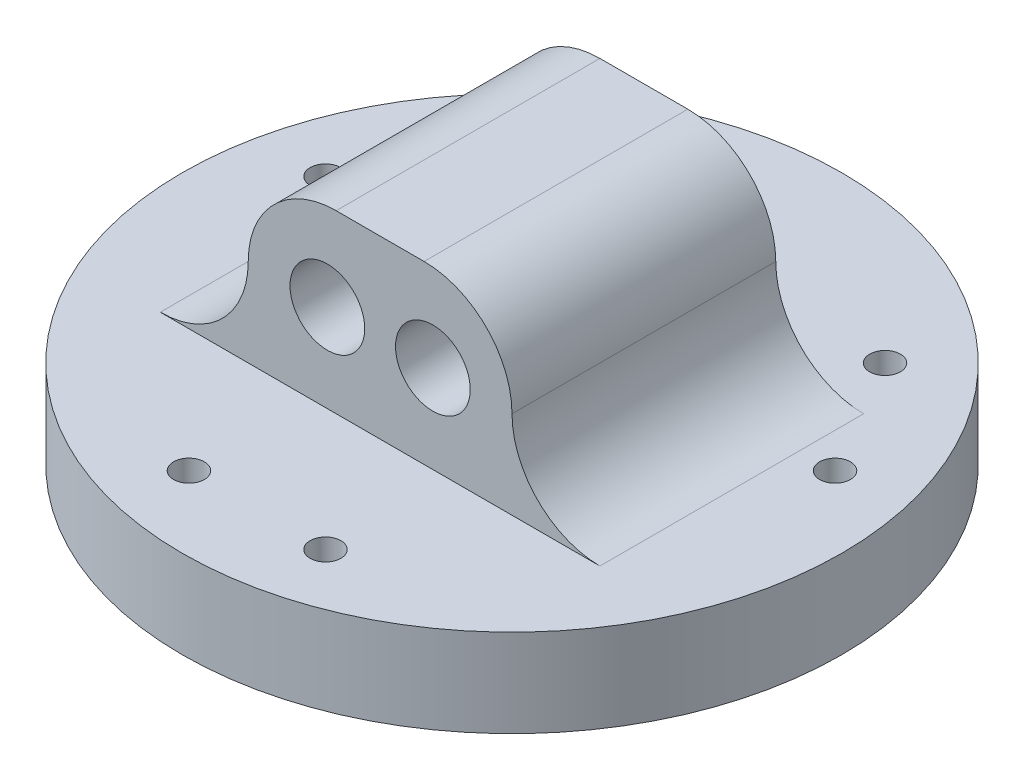
ISO-10303-21;
HEADER;
FILE_DESCRIPTION(('STEP AP214'),'2;1');
FILE_NAME('part.step','',(''),(''),'','','');
FILE_SCHEMA(('AUTOMOTIVE_DESIGN { 1 0 10303 214 1 1 1 1 }'));
ENDSEC;
DATA;
#1=APPLICATION_CONTEXT('core data for automotive mechanical design processes');
#2=APPLICATION_PROTOCOL_DEFINITION('international standard','automotive_design',2000,#1);
#3=PRODUCT_CONTEXT('',#1,'mechanical');
#4=PRODUCT('Part','Part','',(#3));
#5=PRODUCT_RELATED_PRODUCT_CATEGORY('part','',(#4));
#6=PRODUCT_DEFINITION_FORMATION('','',#4);
#7=PRODUCT_DEFINITION_CONTEXT('part definition',#1,'design');
#8=PRODUCT_DEFINITION('design','',#6,#7);
#9=PRODUCT_DEFINITION_SHAPE('','',#8);
#10=(LENGTH_UNIT() NAMED_UNIT(*) SI_UNIT(.MILLI.,.METRE.));
#11=(NAMED_UNIT(*) PLANE_ANGLE_UNIT() SI_UNIT($,.RADIAN.));
#12=(NAMED_UNIT(*) SI_UNIT($,.STERADIAN.) SOLID_ANGLE_UNIT());
#13=UNCERTAINTY_MEASURE_WITH_UNIT(LENGTH_MEASURE(1.E-05),#10,'distance_accuracy_value','');
#14=(GEOMETRIC_REPRESENTATION_CONTEXT(3) GLOBAL_UNCERTAINTY_ASSIGNED_CONTEXT((#13)) GLOBAL_UNIT_ASSIGNED_CONTEXT((#10,
#11,#12)) REPRESENTATION_CONTEXT('',''));
#15=CARTESIAN_POINT('',(0.,0.,0.));
#16=DIRECTION('',(0.,0.,1.));
#17=DIRECTION('',(1.,0.,0.));
#18=AXIS2_PLACEMENT_3D('',#15,#16,#17);
#19=CARTESIAN_POINT('',(0.,10.,0.));
#20=DIRECTION('',(0.,1.,0.));
#21=DIRECTION('',(0.,0.,1.));
#22=AXIS2_PLACEMENT_3D('',#19,#20,#21);
#23=PLANE('',#22);
#24=CARTESIAN_POINT('',(7.76457135307535,10.,28.9777747886721));
#25=DIRECTION('',(0.,1.,0.));
#26=DIRECTION('',(-0.866025403784436,0.,-0.500000000000004));
#27=AXIS2_PLACEMENT_3D('',#24,#25,#26);
#28=CIRCLE('',#27,1.75000000000001);
#29=CARTESIAN_POINT('',(6.24902689645258,10.,28.1027747886721));
#30=VERTEX_POINT('',#29);
#31=EDGE_CURVE('E156',#30,#30,#28,.T.);
#32=ORIENTED_EDGE('',*,*,#31,.F.);
#33=EDGE_LOOP('',(#32));
#34=FACE_BOUND('',#33,.T.);
#35=CARTESIAN_POINT('',(-7.76457135307574,10.,28.977774788672));
#36=DIRECTION('',(0.,1.,0.));
#37=DIRECTION('',(-0.866025403784436,0.,-0.500000000000004));
#38=AXIS2_PLACEMENT_3D('',#35,#36,#37);
#39=CIRCLE('',#38,1.75);
#40=CARTESIAN_POINT('',(-9.2801158096985,10.,28.102774788672));
#41=VERTEX_POINT('',#40);
#42=EDGE_CURVE('E162',#41,#41,#39,.T.);
#43=ORIENTED_EDGE('',*,*,#42,.F.);
#44=EDGE_LOOP('',(#43));
#45=FACE_BOUND('',#44,.T.);
#46=CARTESIAN_POINT('',(-28.9777747886719,10.,-7.76457135307604));
#47=DIRECTION('',(0.,1.,0.));
#48=DIRECTION('',(0.866025403784443,0.,-0.499999999999992));
#49=AXIS2_PLACEMENT_3D('',#46,#47,#48);
#50=CIRCLE('',#49,1.75000000000001);
#51=CARTESIAN_POINT('',(-27.4622303320492,10.,-8.63957135307602));
#52=VERTEX_POINT('',#51);
#53=EDGE_CURVE('E168',#52,#52,#50,.T.);
#54=ORIENTED_EDGE('',*,*,#53,.F.);
#55=EDGE_LOOP('',(#54));
#56=FACE_BOUND('',#55,.T.);
#57=CARTESIAN_POINT('',(-21.2132034355962,10.,-21.2132034355966));
#58=DIRECTION('',(0.,1.,0.));
#59=DIRECTION('',(0.866025403784443,0.,-0.499999999999992));
#60=AXIS2_PLACEMENT_3D('',#57,#58,#59);
#61=CIRCLE('',#60,1.75);
#62=CARTESIAN_POINT('',(-19.6976589789735,10.,-22.0882034355966));
#63=VERTEX_POINT('',#62);
#64=EDGE_CURVE('E149',#63,#63,#61,.T.);
#65=ORIENTED_EDGE('',*,*,#64,.F.);
#66=EDGE_LOOP('',(#65));
#67=FACE_BOUND('',#66,.T.);
#68=CARTESIAN_POINT('',(21.2132034355965,10.,-21.2132034355963));
#69=DIRECTION('',(0.,1.,0.));
#70=DIRECTION('',(0.,0.,1.));
#71=AXIS2_PLACEMENT_3D('',#68,#69,#70);
#72=CIRCLE('',#71,1.75000000000001);
#73=CARTESIAN_POINT('',(21.2132034355965,10.,-19.4632034355963));
#74=VERTEX_POINT('',#73);
#75=EDGE_CURVE('E180',#74,#74,#72,.T.);
#76=ORIENTED_EDGE('',*,*,#75,.F.);
#77=EDGE_LOOP('',(#76));
#78=FACE_BOUND('',#77,.T.);
#79=CARTESIAN_POINT('',(28.977774788672,10.,-7.76457135307565));
#80=DIRECTION('',(0.,1.,0.));
#81=DIRECTION('',(0.,0.,1.));
#82=AXIS2_PLACEMENT_3D('',#79,#80,#81);
#83=CIRCLE('',#82,1.75);
#84=CARTESIAN_POINT('',(28.977774788672,10.,-6.01457135307564));
#85=VERTEX_POINT('',#84);
#86=EDGE_CURVE('E183',#85,#85,#83,.T.);
#87=ORIENTED_EDGE('',*,*,#86,.F.);
#88=EDGE_LOOP('',(#87));
#89=FACE_BOUND('',#88,.T.);
#90=CARTESIAN_POINT('',(0.,10.,0.));
#91=DIRECTION('',(0.,1.,0.));
#92=DIRECTION('',(0.,0.,1.));
#93=AXIS2_PLACEMENT_3D('',#90,#91,#92);
#94=CIRCLE('',#93,37.5);
#95=CARTESIAN_POINT('',(0.,10.,37.5));
#96=VERTEX_POINT('',#95);
#97=EDGE_CURVE('E108',#96,#96,#94,.T.);
#98=ORIENTED_EDGE('',*,*,#97,.T.);
#99=EDGE_LOOP('',(#98));
#100=FACE_BOUND('',#99,.T.);
#101=DIRECTION('',(-1.,0.,0.));
#102=VECTOR('',#101,1.);
#103=CARTESIAN_POINT('',(-15.,10.,-15.));
#104=LINE('',#103,#102);
#105=CARTESIAN_POINT('',(25.,10.,-15.));
#106=VERTEX_POINT('',#105);
#107=CARTESIAN_POINT('',(-25.,10.,-15.));
#108=VERTEX_POINT('',#107);
#109=EDGE_CURVE('E90',#106,#108,#104,.T.);
#110=ORIENTED_EDGE('',*,*,#109,.F.);
#111=DIRECTION('',(0.,0.,-1.));
#112=VECTOR('',#111,1.);
#113=CARTESIAN_POINT('',(25.,10.,0.));
#114=LINE('',#113,#112);
#115=CARTESIAN_POINT('',(25.,10.,15.));
#116=VERTEX_POINT('',#115);
#117=EDGE_CURVE('E107',#106,#116,#114,.F.);
#118=ORIENTED_EDGE('',*,*,#117,.T.);
#119=DIRECTION('',(1.,0.,0.));
#120=VECTOR('',#119,1.);
#121=CARTESIAN_POINT('',(-15.,10.,15.));
#122=LINE('',#121,#120);
#123=CARTESIAN_POINT('',(-25.,10.,15.));
#124=VERTEX_POINT('',#123);
#125=EDGE_CURVE('E101',#124,#116,#122,.T.);
#126=ORIENTED_EDGE('',*,*,#125,.F.);
#127=DIRECTION('',(0.,0.,1.));
#128=VECTOR('',#127,1.);
#129=CARTESIAN_POINT('',(-25.,10.,0.));
#130=LINE('',#129,#128);
#131=EDGE_CURVE('E105',#124,#108,#130,.F.);
#132=ORIENTED_EDGE('',*,*,#131,.T.);
#133=EDGE_LOOP('',(#110,#118,#126,#132));
#134=FACE_BOUND('',#133,.T.);
#135=ADVANCED_FACE('F37',(#34,#45,#56,#67,#78,#89,#100,#134),#23,.T.);
#136=CARTESIAN_POINT('',(0.,10.,0.));
#137=DIRECTION('',(0.,-1.,0.));
#138=DIRECTION('',(0.,0.,-1.));
#139=AXIS2_PLACEMENT_3D('',#136,#137,#138);
#140=CYLINDRICAL_SURFACE('',#139,37.5);
#141=ORIENTED_EDGE('',*,*,#97,.F.);
#142=EDGE_LOOP('',(#141));
#143=FACE_BOUND('',#142,.T.);
#144=CARTESIAN_POINT('',(0.,0.,0.));
#145=DIRECTION('',(0.,1.,0.));
#146=DIRECTION('',(0.,0.,1.));
#147=AXIS2_PLACEMENT_3D('',#144,#145,#146);
#148=CIRCLE('',#147,37.5);
#149=CARTESIAN_POINT('',(0.,0.,37.5));
#150=VERTEX_POINT('',#149);
#151=EDGE_CURVE('E179',#150,#150,#148,.T.);
#152=ORIENTED_EDGE('',*,*,#151,.T.);
#153=EDGE_LOOP('',(#152));
#154=FACE_BOUND('',#153,.T.);
#155=ADVANCED_FACE('F214',(#143,#154),#140,.T.);
#156=CARTESIAN_POINT('',(0.,0.,0.));
#157=DIRECTION('',(0.,1.,0.));
#158=DIRECTION('',(0.,0.,1.));
#159=AXIS2_PLACEMENT_3D('',#156,#157,#158);
#160=PLANE('',#159);
#161=CARTESIAN_POINT('',(7.76457135307535,0.,28.9777747886721));
#162=DIRECTION('',(0.,1.,0.));
#163=DIRECTION('',(-0.866025403784436,0.,-0.500000000000004));
#164=AXIS2_PLACEMENT_3D('',#161,#162,#163);
#165=CIRCLE('',#164,1.75000000000001);
#166=CARTESIAN_POINT('',(6.24902689645258,0.,28.1027747886721));
#167=VERTEX_POINT('',#166);
#168=EDGE_CURVE('E152',#167,#167,#165,.T.);
#169=ORIENTED_EDGE('',*,*,#168,.T.);
#170=EDGE_LOOP('',(#169));
#171=FACE_BOUND('',#170,.T.);
#172=CARTESIAN_POINT('',(-7.76457135307574,0.,28.977774788672));
#173=DIRECTION('',(0.,1.,0.));
#174=DIRECTION('',(-0.866025403784436,0.,-0.500000000000004));
#175=AXIS2_PLACEMENT_3D('',#172,#173,#174);
#176=CIRCLE('',#175,1.75);
#177=CARTESIAN_POINT('',(-9.2801158096985,0.,28.102774788672));
#178=VERTEX_POINT('',#177);
#179=EDGE_CURVE('E159',#178,#178,#176,.T.);
#180=ORIENTED_EDGE('',*,*,#179,.T.);
#181=EDGE_LOOP('',(#180));
#182=FACE_BOUND('',#181,.T.);
#183=CARTESIAN_POINT('',(-28.9777747886719,0.,-7.76457135307604));
#184=DIRECTION('',(0.,1.,0.));
#185=DIRECTION('',(0.866025403784443,0.,-0.499999999999992));
#186=AXIS2_PLACEMENT_3D('',#183,#184,#185);
#187=CIRCLE('',#186,1.75000000000001);
#188=CARTESIAN_POINT('',(-27.4622303320492,0.,-8.63957135307602));
#189=VERTEX_POINT('',#188);
#190=EDGE_CURVE('E165',#189,#189,#187,.T.);
#191=ORIENTED_EDGE('',*,*,#190,.T.);
#192=EDGE_LOOP('',(#191));
#193=FACE_BOUND('',#192,.T.);
#194=CARTESIAN_POINT('',(-21.2132034355962,0.,-21.2132034355966));
#195=DIRECTION('',(0.,1.,0.));
#196=DIRECTION('',(0.866025403784443,0.,-0.499999999999992));
#197=AXIS2_PLACEMENT_3D('',#194,#195,#196);
#198=CIRCLE('',#197,1.75);
#199=CARTESIAN_POINT('',(-19.6976589789735,0.,-22.0882034355966));
#200=VERTEX_POINT('',#199);
#201=EDGE_CURVE('E171',#200,#200,#198,.T.);
#202=ORIENTED_EDGE('',*,*,#201,.T.);
#203=EDGE_LOOP('',(#202));
#204=FACE_BOUND('',#203,.T.);
#205=CARTESIAN_POINT('',(21.2132034355965,0.,-21.2132034355963));
#206=DIRECTION('',(0.,1.,0.));
#207=DIRECTION('',(0.,0.,1.));
#208=AXIS2_PLACEMENT_3D('',#205,#206,#207);
#209=CIRCLE('',#208,1.75000000000001);
#210=CARTESIAN_POINT('',(21.2132034355965,0.,-19.4632034355963));
#211=VERTEX_POINT('',#210);
#212=EDGE_CURVE('E176',#211,#211,#209,.T.);
#213=ORIENTED_EDGE('',*,*,#212,.T.);
#214=EDGE_LOOP('',(#213));
#215=FACE_BOUND('',#214,.T.);
#216=CARTESIAN_POINT('',(28.977774788672,0.,-7.76457135307565));
#217=DIRECTION('',(0.,1.,0.));
#218=DIRECTION('',(0.,0.,1.));
#219=AXIS2_PLACEMENT_3D('',#216,#217,#218);
#220=CIRCLE('',#219,1.75);
#221=CARTESIAN_POINT('',(28.977774788672,0.,-6.01457135307564));
#222=VERTEX_POINT('',#221);
#223=EDGE_CURVE('E155',#222,#222,#220,.T.);
#224=ORIENTED_EDGE('',*,*,#223,.T.);
#225=EDGE_LOOP('',(#224));
#226=FACE_BOUND('',#225,.T.);
#227=ORIENTED_EDGE('',*,*,#151,.F.);
#228=EDGE_LOOP('',(#227));
#229=FACE_BOUND('',#228,.T.);
#230=ADVANCED_FACE('F222',(#171,#182,#193,#204,#215,#226,#229),#160,.F.);
#231=CARTESIAN_POINT('',(28.977774788672,0.,-7.76457135307565));
#232=DIRECTION('',(0.,1.,0.));
#233=DIRECTION('',(0.,0.,1.));
#234=AXIS2_PLACEMENT_3D('',#231,#232,#233);
#235=CYLINDRICAL_SURFACE('',#234,1.75);
#236=ORIENTED_EDGE('',*,*,#223,.F.);
#237=EDGE_LOOP('',(#236));
#238=FACE_BOUND('',#237,.T.);
#239=ORIENTED_EDGE('',*,*,#86,.T.);
#240=EDGE_LOOP('',(#239));
#241=FACE_BOUND('',#240,.T.);
#242=ADVANCED_FACE('F228',(#238,#241),#235,.F.);
#243=CARTESIAN_POINT('',(21.2132034355965,0.,-21.2132034355963));
#244=DIRECTION('',(0.,1.,0.));
#245=DIRECTION('',(0.,0.,1.));
#246=AXIS2_PLACEMENT_3D('',#243,#244,#245);
#247=CYLINDRICAL_SURFACE('',#246,1.75000000000001);
#248=ORIENTED_EDGE('',*,*,#212,.F.);
#249=EDGE_LOOP('',(#248));
#250=FACE_BOUND('',#249,.T.);
#251=ORIENTED_EDGE('',*,*,#75,.T.);
#252=EDGE_LOOP('',(#251));
#253=FACE_BOUND('',#252,.T.);
#254=ADVANCED_FACE('F235',(#250,#253),#247,.F.);
#255=CARTESIAN_POINT('',(-21.2132034355962,0.,-21.2132034355966));
#256=DIRECTION('',(0.,1.,0.));
#257=DIRECTION('',(0.,0.,1.));
#258=AXIS2_PLACEMENT_3D('',#255,#256,#257);
#259=CYLINDRICAL_SURFACE('',#258,1.75);
#260=ORIENTED_EDGE('',*,*,#201,.F.);
#261=EDGE_LOOP('',(#260));
#262=FACE_BOUND('',#261,.T.);
#263=ORIENTED_EDGE('',*,*,#64,.T.);
#264=EDGE_LOOP('',(#263));
#265=FACE_BOUND('',#264,.T.);
#266=ADVANCED_FACE('F259',(#262,#265),#259,.F.);
#267=CARTESIAN_POINT('',(-28.9777747886719,0.,-7.76457135307604));
#268=DIRECTION('',(0.,1.,0.));
#269=DIRECTION('',(0.,0.,1.));
#270=AXIS2_PLACEMENT_3D('',#267,#268,#269);
#271=CYLINDRICAL_SURFACE('',#270,1.75000000000001);
#272=ORIENTED_EDGE('',*,*,#190,.F.);
#273=EDGE_LOOP('',(#272));
#274=FACE_BOUND('',#273,.T.);
#275=ORIENTED_EDGE('',*,*,#53,.T.);
#276=EDGE_LOOP('',(#275));
#277=FACE_BOUND('',#276,.T.);
#278=ADVANCED_FACE('F265',(#274,#277),#271,.F.);
#279=CARTESIAN_POINT('',(-7.76457135307574,0.,28.977774788672));
#280=DIRECTION('',(0.,1.,0.));
#281=DIRECTION('',(0.,0.,1.));
#282=AXIS2_PLACEMENT_3D('',#279,#280,#281);
#283=CYLINDRICAL_SURFACE('',#282,1.75);
#284=ORIENTED_EDGE('',*,*,#179,.F.);
#285=EDGE_LOOP('',(#284));
#286=FACE_BOUND('',#285,.T.);
#287=ORIENTED_EDGE('',*,*,#42,.T.);
#288=EDGE_LOOP('',(#287));
#289=FACE_BOUND('',#288,.T.);
#290=ADVANCED_FACE('F271',(#286,#289),#283,.F.);
#291=CARTESIAN_POINT('',(7.76457135307535,0.,28.9777747886721));
#292=DIRECTION('',(0.,1.,0.));
#293=DIRECTION('',(0.,0.,1.));
#294=AXIS2_PLACEMENT_3D('',#291,#292,#293);
#295=CYLINDRICAL_SURFACE('',#294,1.75000000000001);
#296=ORIENTED_EDGE('',*,*,#168,.F.);
#297=EDGE_LOOP('',(#296));
#298=FACE_BOUND('',#297,.T.);
#299=ORIENTED_EDGE('',*,*,#31,.T.);
#300=EDGE_LOOP('',(#299));
#301=FACE_BOUND('',#300,.T.);
#302=ADVANCED_FACE('F275',(#298,#301),#295,.F.);
#303=CARTESIAN_POINT('',(-15.,30.,-15.));
#304=DIRECTION('',(0.,0.,1.));
#305=DIRECTION('',(1.,0.,0.));
#306=AXIS2_PLACEMENT_3D('',#303,#304,#305);
#307=PLANE('',#306);
#308=CARTESIAN_POINT('',(6.,20.,-15.));
#309=DIRECTION('',(0.,0.,1.));
#310=DIRECTION('',(1.,0.,0.));
#311=AXIS2_PLACEMENT_3D('',#308,#309,#310);
#312=CIRCLE('',#311,4.25);
#313=CARTESIAN_POINT('',(10.25,20.,-15.));
#314=VERTEX_POINT('',#313);
#315=EDGE_CURVE('E137',#314,#314,#312,.T.);
#316=ORIENTED_EDGE('',*,*,#315,.T.);
#317=EDGE_LOOP('',(#316));
#318=FACE_BOUND('',#317,.T.);
#319=CARTESIAN_POINT('',(-6.,20.,-15.));
#320=DIRECTION('',(0.,0.,1.));
#321=DIRECTION('',(1.,0.,0.));
#322=AXIS2_PLACEMENT_3D('',#319,#320,#321);
#323=CIRCLE('',#322,4.25);
#324=CARTESIAN_POINT('',(-1.75,20.,-15.));
#325=VERTEX_POINT('',#324);
#326=EDGE_CURVE('E133',#325,#325,#323,.T.);
#327=ORIENTED_EDGE('',*,*,#326,.T.);
#328=EDGE_LOOP('',(#327));
#329=FACE_BOUND('',#328,.T.);
#330=DIRECTION('',(-1.,0.,0.));
#331=VECTOR('',#330,1.);
#332=CARTESIAN_POINT('',(-15.,30.,-15.));
#333=LINE('',#332,#331);
#334=CARTESIAN_POINT('',(5.,30.,-15.));
#335=VERTEX_POINT('',#334);
#336=CARTESIAN_POINT('',(-5.,30.,-15.));
#337=VERTEX_POINT('',#336);
#338=EDGE_CURVE('E145',#335,#337,#333,.T.);
#339=ORIENTED_EDGE('',*,*,#338,.F.);
#340=CARTESIAN_POINT('',(5.,20.,-15.));
#341=DIRECTION('',(0.,0.,1.));
#342=DIRECTION('',(1.,0.,0.));
#343=AXIS2_PLACEMENT_3D('',#340,#341,#342);
#344=CIRCLE('',#343,10.);
#345=CARTESIAN_POINT('',(15.,20.,-15.));
#346=VERTEX_POINT('',#345);
#347=EDGE_CURVE('E120',#335,#346,#344,.F.);
#348=ORIENTED_EDGE('',*,*,#347,.T.);
#349=CARTESIAN_POINT('',(25.,20.,-15.));
#350=DIRECTION('',(0.,0.,1.));
#351=DIRECTION('',(1.,0.,0.));
#352=AXIS2_PLACEMENT_3D('',#349,#350,#351);
#353=CIRCLE('',#352,10.);
#354=EDGE_CURVE('E97',#346,#106,#353,.T.);
#355=ORIENTED_EDGE('',*,*,#354,.T.);
#356=ORIENTED_EDGE('',*,*,#109,.T.);
#357=CARTESIAN_POINT('',(-25.,20.,-15.));
#358=DIRECTION('',(0.,0.,1.));
#359=DIRECTION('',(1.,0.,0.));
#360=AXIS2_PLACEMENT_3D('',#357,#358,#359);
#361=CIRCLE('',#360,10.);
#362=CARTESIAN_POINT('',(-15.,20.,-15.));
#363=VERTEX_POINT('',#362);
#364=EDGE_CURVE('E11',#108,#363,#361,.T.);
#365=ORIENTED_EDGE('',*,*,#364,.T.);
#366=CARTESIAN_POINT('',(-5.,20.,-15.));
#367=DIRECTION('',(0.,0.,1.));
#368=DIRECTION('',(1.,0.,0.));
#369=AXIS2_PLACEMENT_3D('',#366,#367,#368);
#370=CIRCLE('',#369,10.);
#371=EDGE_CURVE('E115',#363,#337,#370,.F.);
#372=ORIENTED_EDGE('',*,*,#371,.T.);
#373=EDGE_LOOP('',(#339,#348,#355,#356,#365,#372));
#374=FACE_BOUND('',#373,.T.);
#375=ADVANCED_FACE('F93',(#318,#329,#374),#307,.F.);
#376=CARTESIAN_POINT('',(-15.,30.,15.));
#377=DIRECTION('',(0.,0.,-1.));
#378=DIRECTION('',(-1.,0.,0.));
#379=AXIS2_PLACEMENT_3D('',#376,#377,#378);
#380=PLANE('',#379);
#381=CARTESIAN_POINT('',(6.,20.,15.));
#382=DIRECTION('',(0.,0.,-1.));
#383=DIRECTION('',(-1.,0.,0.));
#384=AXIS2_PLACEMENT_3D('',#381,#382,#383);
#385=CIRCLE('',#384,4.25);
#386=CARTESIAN_POINT('',(1.75,20.,15.));
#387=VERTEX_POINT('',#386);
#388=EDGE_CURVE('E102',#387,#387,#385,.F.);
#389=ORIENTED_EDGE('',*,*,#388,.F.);
#390=EDGE_LOOP('',(#389));
#391=FACE_BOUND('',#390,.T.);
#392=CARTESIAN_POINT('',(-6.,20.,15.));
#393=DIRECTION('',(0.,0.,-1.));
#394=DIRECTION('',(-1.,0.,0.));
#395=AXIS2_PLACEMENT_3D('',#392,#393,#394);
#396=CIRCLE('',#395,4.25);
#397=CARTESIAN_POINT('',(-10.25,20.,15.));
#398=VERTEX_POINT('',#397);
#399=EDGE_CURVE('E142',#398,#398,#396,.F.);
#400=ORIENTED_EDGE('',*,*,#399,.F.);
#401=EDGE_LOOP('',(#400));
#402=FACE_BOUND('',#401,.T.);
#403=ORIENTED_EDGE('',*,*,#125,.T.);
#404=CARTESIAN_POINT('',(25.,20.,15.));
#405=DIRECTION('',(0.,0.,-1.));
#406=DIRECTION('',(-1.,0.,0.));
#407=AXIS2_PLACEMENT_3D('',#404,#405,#406);
#408=CIRCLE('',#407,10.);
#409=CARTESIAN_POINT('',(15.,20.,15.));
#410=VERTEX_POINT('',#409);
#411=EDGE_CURVE('E61',#116,#410,#408,.T.);
#412=ORIENTED_EDGE('',*,*,#411,.T.);
#413=CARTESIAN_POINT('',(5.,20.,15.));
#414=DIRECTION('',(0.,0.,-1.));
#415=DIRECTION('',(-1.,0.,0.));
#416=AXIS2_PLACEMENT_3D('',#413,#414,#415);
#417=CIRCLE('',#416,10.);
#418=CARTESIAN_POINT('',(5.,30.,15.));
#419=VERTEX_POINT('',#418);
#420=EDGE_CURVE('E128',#410,#419,#417,.F.);
#421=ORIENTED_EDGE('',*,*,#420,.T.);
#422=DIRECTION('',(1.,0.,0.));
#423=VECTOR('',#422,1.);
#424=CARTESIAN_POINT('',(-15.,30.,15.));
#425=LINE('',#424,#423);
#426=CARTESIAN_POINT('',(-5.,30.,15.));
#427=VERTEX_POINT('',#426);
#428=EDGE_CURVE('E147',#427,#419,#425,.T.);
#429=ORIENTED_EDGE('',*,*,#428,.F.);
#430=CARTESIAN_POINT('',(-5.,20.,15.));
#431=DIRECTION('',(0.,0.,-1.));
#432=DIRECTION('',(-1.,0.,0.));
#433=AXIS2_PLACEMENT_3D('',#430,#431,#432);
#434=CIRCLE('',#433,10.);
#435=CARTESIAN_POINT('',(-15.,20.,15.));
#436=VERTEX_POINT('',#435);
#437=EDGE_CURVE('E54',#427,#436,#434,.F.);
#438=ORIENTED_EDGE('',*,*,#437,.T.);
#439=CARTESIAN_POINT('',(-25.,20.,15.));
#440=DIRECTION('',(0.,0.,-1.));
#441=DIRECTION('',(-1.,0.,0.));
#442=AXIS2_PLACEMENT_3D('',#439,#440,#441);
#443=CIRCLE('',#442,10.);
#444=EDGE_CURVE('E46',#436,#124,#443,.T.);
#445=ORIENTED_EDGE('',*,*,#444,.T.);
#446=EDGE_LOOP('',(#403,#412,#421,#429,#438,#445));
#447=FACE_BOUND('',#446,.T.);
#448=ADVANCED_FACE('F199',(#391,#402,#447),#380,.F.);
#449=CARTESIAN_POINT('',(0.,30.,0.));
#450=DIRECTION('',(0.,1.,0.));
#451=DIRECTION('',(0.,0.,1.));
#452=AXIS2_PLACEMENT_3D('',#449,#450,#451);
#453=PLANE('',#452);
#454=ORIENTED_EDGE('',*,*,#428,.T.);
#455=DIRECTION('',(0.,0.,-1.));
#456=VECTOR('',#455,1.);
#457=CARTESIAN_POINT('',(5.,30.,-15.));
#458=LINE('',#457,#456);
#459=EDGE_CURVE('E121',#419,#335,#458,.T.);
#460=ORIENTED_EDGE('',*,*,#459,.T.);
#461=ORIENTED_EDGE('',*,*,#338,.T.);
#462=DIRECTION('',(0.,0.,1.));
#463=VECTOR('',#462,1.);
#464=CARTESIAN_POINT('',(-5.,30.,15.));
#465=LINE('',#464,#463);
#466=EDGE_CURVE('E118',#337,#427,#465,.T.);
#467=ORIENTED_EDGE('',*,*,#466,.T.);
#468=EDGE_LOOP('',(#454,#460,#461,#467));
#469=FACE_BOUND('',#468,.T.);
#470=ADVANCED_FACE('F197',(#469),#453,.T.);
#471=CARTESIAN_POINT('',(-6.,20.,37.5));
#472=DIRECTION('',(0.,0.,-1.));
#473=DIRECTION('',(-1.,0.,0.));
#474=AXIS2_PLACEMENT_3D('',#471,#472,#473);
#475=CYLINDRICAL_SURFACE('',#474,4.25);
#476=ORIENTED_EDGE('',*,*,#326,.F.);
#477=EDGE_LOOP('',(#476));
#478=FACE_BOUND('',#477,.T.);
#479=ORIENTED_EDGE('',*,*,#399,.T.);
#480=EDGE_LOOP('',(#479));
#481=FACE_BOUND('',#480,.T.);
#482=ADVANCED_FACE('F288',(#478,#481),#475,.F.);
#483=CARTESIAN_POINT('',(6.,20.,37.5));
#484=DIRECTION('',(0.,0.,-1.));
#485=DIRECTION('',(-1.,0.,0.));
#486=AXIS2_PLACEMENT_3D('',#483,#484,#485);
#487=CYLINDRICAL_SURFACE('',#486,4.25);
#488=ORIENTED_EDGE('',*,*,#315,.F.);
#489=EDGE_LOOP('',(#488));
#490=FACE_BOUND('',#489,.T.);
#491=ORIENTED_EDGE('',*,*,#388,.T.);
#492=EDGE_LOOP('',(#491));
#493=FACE_BOUND('',#492,.T.);
#494=ADVANCED_FACE('F210',(#490,#493),#487,.F.);
#495=CARTESIAN_POINT('',(5.,20.,0.));
#496=DIRECTION('',(0.,0.,1.));
#497=DIRECTION('',(1.,0.,0.));
#498=AXIS2_PLACEMENT_3D('',#495,#496,#497);
#499=CYLINDRICAL_SURFACE('',#498,10.);
#500=ORIENTED_EDGE('',*,*,#459,.F.);
#501=ORIENTED_EDGE('',*,*,#420,.F.);
#502=DIRECTION('',(0.,0.,-1.));
#503=VECTOR('',#502,1.);
#504=CARTESIAN_POINT('',(15.,20.,15.));
#505=LINE('',#504,#503);
#506=EDGE_CURVE('E113',#346,#410,#505,.F.);
#507=ORIENTED_EDGE('',*,*,#506,.F.);
#508=ORIENTED_EDGE('',*,*,#347,.F.);
#509=EDGE_LOOP('',(#500,#501,#507,#508));
#510=FACE_BOUND('',#509,.T.);
#511=ADVANCED_FACE('F201',(#510),#499,.T.);
#512=CARTESIAN_POINT('',(25.,20.,-15.));
#513=DIRECTION('',(0.,0.,-1.));
#514=DIRECTION('',(-1.,0.,0.));
#515=AXIS2_PLACEMENT_3D('',#512,#513,#514);
#516=CYLINDRICAL_SURFACE('',#515,10.);
#517=ORIENTED_EDGE('',*,*,#411,.F.);
#518=ORIENTED_EDGE('',*,*,#117,.F.);
#519=ORIENTED_EDGE('',*,*,#354,.F.);
#520=ORIENTED_EDGE('',*,*,#506,.T.);
#521=EDGE_LOOP('',(#517,#518,#519,#520));
#522=FACE_BOUND('',#521,.T.);
#523=ADVANCED_FACE('F203',(#522),#516,.F.);
#524=CARTESIAN_POINT('',(-25.,20.,-15.));
#525=DIRECTION('',(0.,0.,1.));
#526=DIRECTION('',(1.,0.,0.));
#527=AXIS2_PLACEMENT_3D('',#524,#525,#526);
#528=CYLINDRICAL_SURFACE('',#527,10.);
#529=DIRECTION('',(0.,0.,1.));
#530=VECTOR('',#529,1.);
#531=CARTESIAN_POINT('',(-15.,20.,-15.));
#532=LINE('',#531,#530);
#533=EDGE_CURVE('E41',#363,#436,#532,.T.);
#534=ORIENTED_EDGE('',*,*,#533,.F.);
#535=ORIENTED_EDGE('',*,*,#364,.F.);
#536=ORIENTED_EDGE('',*,*,#131,.F.);
#537=ORIENTED_EDGE('',*,*,#444,.F.);
#538=EDGE_LOOP('',(#534,#535,#536,#537));
#539=FACE_BOUND('',#538,.T.);
#540=ADVANCED_FACE('F39',(#539),#528,.F.);
#541=CARTESIAN_POINT('',(-5.,20.,0.));
#542=DIRECTION('',(0.,0.,-1.));
#543=DIRECTION('',(-1.,0.,0.));
#544=AXIS2_PLACEMENT_3D('',#541,#542,#543);
#545=CYLINDRICAL_SURFACE('',#544,10.);
#546=ORIENTED_EDGE('',*,*,#371,.F.);
#547=ORIENTED_EDGE('',*,*,#533,.T.);
#548=ORIENTED_EDGE('',*,*,#437,.F.);
#549=ORIENTED_EDGE('',*,*,#466,.F.);
#550=EDGE_LOOP('',(#546,#547,#548,#549));
#551=FACE_BOUND('',#550,.T.);
#552=ADVANCED_FACE('F116',(#551),#545,.T.);
#553=CLOSED_SHELL('',(#135,#155,#230,#242,#254,#266,#278,#290,#302,#375,#448,#470,#482,#494,
#511,#523,#540,#552));
#554=MANIFOLD_SOLID_BREP('B2',#553);
#555=ADVANCED_BREP_SHAPE_REPRESENTATION('',(#18,#554),#14);
#556=SHAPE_DEFINITION_REPRESENTATION(#9,#555);
ENDSEC;
END-ISO-10303-21;
